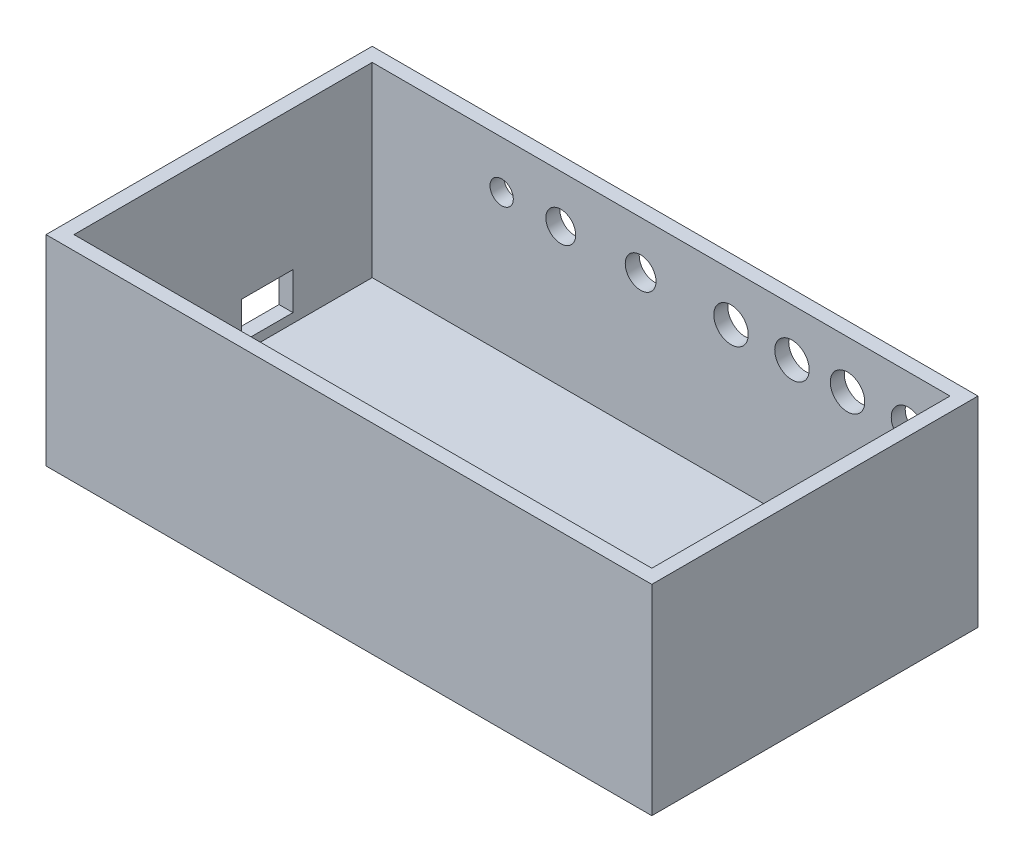
ISO-10303-21;
HEADER;
FILE_DESCRIPTION(('STEP AP214'),'2;1');
FILE_NAME('part.step','',(''),(''),'','','');
FILE_SCHEMA(('AUTOMOTIVE_DESIGN { 1 0 10303 214 1 1 1 1 }'));
ENDSEC;
DATA;
#1=APPLICATION_CONTEXT('core data for automotive mechanical design processes');
#2=APPLICATION_PROTOCOL_DEFINITION('international standard','automotive_design',2000,#1);
#3=PRODUCT_CONTEXT('',#1,'mechanical');
#4=PRODUCT('Part','Part','',(#3));
#5=PRODUCT_RELATED_PRODUCT_CATEGORY('part','',(#4));
#6=PRODUCT_DEFINITION_FORMATION('','',#4);
#7=PRODUCT_DEFINITION_CONTEXT('part definition',#1,'design');
#8=PRODUCT_DEFINITION('design','',#6,#7);
#9=PRODUCT_DEFINITION_SHAPE('','',#8);
#10=(LENGTH_UNIT() NAMED_UNIT(*) SI_UNIT(.MILLI.,.METRE.));
#11=(NAMED_UNIT(*) PLANE_ANGLE_UNIT() SI_UNIT($,.RADIAN.));
#12=(NAMED_UNIT(*) SI_UNIT($,.STERADIAN.) SOLID_ANGLE_UNIT());
#13=UNCERTAINTY_MEASURE_WITH_UNIT(LENGTH_MEASURE(1.E-05),#10,'distance_accuracy_value','');
#14=(GEOMETRIC_REPRESENTATION_CONTEXT(3) GLOBAL_UNCERTAINTY_ASSIGNED_CONTEXT((#13)) GLOBAL_UNIT_ASSIGNED_CONTEXT((#10,
#11,#12)) REPRESENTATION_CONTEXT('',''));
#15=CARTESIAN_POINT('',(0.,0.,0.));
#16=DIRECTION('',(0.,0.,1.));
#17=DIRECTION('',(1.,0.,0.));
#18=AXIS2_PLACEMENT_3D('',#15,#16,#17);
#19=CARTESIAN_POINT('',(0.,43.,70.));
#20=DIRECTION('',(1.,0.,0.));
#21=DIRECTION('',(0.,0.,-1.));
#22=AXIS2_PLACEMENT_3D('',#19,#20,#21);
#23=PLANE('',#22);
#24=DIRECTION('',(0.,0.,1.));
#25=VECTOR('',#24,1.);
#26=CARTESIAN_POINT('',(0.,0.,70.));
#27=LINE('',#26,#25);
#28=CARTESIAN_POINT('',(0.,0.,0.));
#29=VERTEX_POINT('',#28);
#30=CARTESIAN_POINT('',(0.,0.,70.));
#31=VERTEX_POINT('',#30);
#32=EDGE_CURVE('E227',#29,#31,#27,.T.);
#33=ORIENTED_EDGE('',*,*,#32,.T.);
#34=DIRECTION('',(0.,-1.,0.));
#35=VECTOR('',#34,1.);
#36=CARTESIAN_POINT('',(0.,43.,70.));
#37=LINE('',#36,#35);
#38=CARTESIAN_POINT('',(0.,43.,70.));
#39=VERTEX_POINT('',#38);
#40=EDGE_CURVE('E274',#39,#31,#37,.T.);
#41=ORIENTED_EDGE('',*,*,#40,.F.);
#42=DIRECTION('',(0.,0.,1.));
#43=VECTOR('',#42,1.);
#44=CARTESIAN_POINT('',(0.,43.,70.));
#45=LINE('',#44,#43);
#46=CARTESIAN_POINT('',(0.,43.,0.));
#47=VERTEX_POINT('',#46);
#48=EDGE_CURVE('E237',#47,#39,#45,.T.);
#49=ORIENTED_EDGE('',*,*,#48,.F.);
#50=DIRECTION('',(0.,-1.,0.));
#51=VECTOR('',#50,1.);
#52=CARTESIAN_POINT('',(0.,43.,0.));
#53=LINE('',#52,#51);
#54=EDGE_CURVE('E251',#47,#29,#53,.T.);
#55=ORIENTED_EDGE('',*,*,#54,.T.);
#56=EDGE_LOOP('',(#33,#41,#49,#55));
#57=FACE_BOUND('',#56,.T.);
#58=DIRECTION('',(0.,0.,1.));
#59=VECTOR('',#58,1.);
#60=CARTESIAN_POINT('',(0.,13.,20.));
#61=LINE('',#60,#59);
#62=CARTESIAN_POINT('',(0.,13.,20.));
#63=VERTEX_POINT('',#62);
#64=CARTESIAN_POINT('',(0.,13.,31.));
#65=VERTEX_POINT('',#64);
#66=EDGE_CURVE('E53',#63,#65,#61,.T.);
#67=ORIENTED_EDGE('',*,*,#66,.T.);
#68=DIRECTION('',(0.,1.,0.));
#69=VECTOR('',#68,1.);
#70=CARTESIAN_POINT('',(0.,5.,31.));
#71=LINE('',#70,#69);
#72=CARTESIAN_POINT('',(0.,5.,31.));
#73=VERTEX_POINT('',#72);
#74=EDGE_CURVE('E136',#73,#65,#71,.T.);
#75=ORIENTED_EDGE('',*,*,#74,.F.);
#76=DIRECTION('',(0.,0.,1.));
#77=VECTOR('',#76,1.);
#78=CARTESIAN_POINT('',(0.,5.,20.));
#79=LINE('',#78,#77);
#80=CARTESIAN_POINT('',(0.,5.,20.));
#81=VERTEX_POINT('',#80);
#82=EDGE_CURVE('E143',#81,#73,#79,.T.);
#83=ORIENTED_EDGE('',*,*,#82,.F.);
#84=DIRECTION('',(0.,1.,0.));
#85=VECTOR('',#84,1.);
#86=CARTESIAN_POINT('',(0.,5.,20.));
#87=LINE('',#86,#85);
#88=EDGE_CURVE('E146',#81,#63,#87,.T.);
#89=ORIENTED_EDGE('',*,*,#88,.T.);
#90=EDGE_LOOP('',(#67,#75,#83,#89));
#91=FACE_BOUND('',#90,.T.);
#92=ADVANCED_FACE('F38',(#57,#91),#23,.F.);
#93=CARTESIAN_POINT('',(3.,3.,3.));
#94=DIRECTION('',(-1.,0.,0.));
#95=DIRECTION('',(0.,0.,1.));
#96=AXIS2_PLACEMENT_3D('',#93,#94,#95);
#97=PLANE('',#96);
#98=DIRECTION('',(0.,0.,1.));
#99=VECTOR('',#98,1.);
#100=CARTESIAN_POINT('',(3.,43.,3.));
#101=LINE('',#100,#99);
#102=CARTESIAN_POINT('',(3.,43.,3.));
#103=VERTEX_POINT('',#102);
#104=CARTESIAN_POINT('',(3.00000000000001,43.,67.));
#105=VERTEX_POINT('',#104);
#106=EDGE_CURVE('E209',#103,#105,#101,.T.);
#107=ORIENTED_EDGE('',*,*,#106,.T.);
#108=DIRECTION('',(0.,1.,0.));
#109=VECTOR('',#108,1.);
#110=CARTESIAN_POINT('',(3.00000000000001,3.,67.));
#111=LINE('',#110,#109);
#112=CARTESIAN_POINT('',(3.00000000000001,3.,67.));
#113=VERTEX_POINT('',#112);
#114=EDGE_CURVE('E208',#113,#105,#111,.T.);
#115=ORIENTED_EDGE('',*,*,#114,.F.);
#116=DIRECTION('',(0.,0.,1.));
#117=VECTOR('',#116,1.);
#118=CARTESIAN_POINT('',(3.,3.,3.));
#119=LINE('',#118,#117);
#120=CARTESIAN_POINT('',(3.,3.,3.));
#121=VERTEX_POINT('',#120);
#122=EDGE_CURVE('E191',#121,#113,#119,.T.);
#123=ORIENTED_EDGE('',*,*,#122,.F.);
#124=DIRECTION('',(0.,1.,0.));
#125=VECTOR('',#124,1.);
#126=CARTESIAN_POINT('',(3.,3.,3.));
#127=LINE('',#126,#125);
#128=EDGE_CURVE('E224',#121,#103,#127,.T.);
#129=ORIENTED_EDGE('',*,*,#128,.T.);
#130=EDGE_LOOP('',(#107,#115,#123,#129));
#131=FACE_BOUND('',#130,.T.);
#132=DIRECTION('',(0.,0.,1.));
#133=VECTOR('',#132,1.);
#134=CARTESIAN_POINT('',(3.,13.,3.));
#135=LINE('',#134,#133);
#136=CARTESIAN_POINT('',(3.,13.,20.));
#137=VERTEX_POINT('',#136);
#138=CARTESIAN_POINT('',(3.,13.,31.));
#139=VERTEX_POINT('',#138);
#140=EDGE_CURVE('E11',#137,#139,#135,.T.);
#141=ORIENTED_EDGE('',*,*,#140,.F.);
#142=DIRECTION('',(0.,1.,0.));
#143=VECTOR('',#142,1.);
#144=CARTESIAN_POINT('',(3.,3.,20.));
#145=LINE('',#144,#143);
#146=CARTESIAN_POINT('',(3.,5.,20.));
#147=VERTEX_POINT('',#146);
#148=EDGE_CURVE('E278',#147,#137,#145,.T.);
#149=ORIENTED_EDGE('',*,*,#148,.F.);
#150=DIRECTION('',(0.,0.,1.));
#151=VECTOR('',#150,1.);
#152=CARTESIAN_POINT('',(3.,5.,3.));
#153=LINE('',#152,#151);
#154=CARTESIAN_POINT('',(3.,5.,31.));
#155=VERTEX_POINT('',#154);
#156=EDGE_CURVE('E305',#147,#155,#153,.T.);
#157=ORIENTED_EDGE('',*,*,#156,.T.);
#158=DIRECTION('',(0.,1.,0.));
#159=VECTOR('',#158,1.);
#160=CARTESIAN_POINT('',(3.,3.,31.));
#161=LINE('',#160,#159);
#162=EDGE_CURVE('E46',#155,#139,#161,.T.);
#163=ORIENTED_EDGE('',*,*,#162,.T.);
#164=EDGE_LOOP('',(#141,#149,#157,#163));
#165=FACE_BOUND('',#164,.T.);
#166=ADVANCED_FACE('F310',(#131,#165),#97,.F.);
#167=CARTESIAN_POINT('',(0.,43.,70.));
#168=DIRECTION('',(0.,0.,-1.));
#169=DIRECTION('',(-1.,0.,0.));
#170=AXIS2_PLACEMENT_3D('',#167,#168,#169);
#171=PLANE('',#170);
#172=DIRECTION('',(1.,0.,0.));
#173=VECTOR('',#172,1.);
#174=CARTESIAN_POINT('',(0.,0.,70.));
#175=LINE('',#174,#173);
#176=CARTESIAN_POINT('',(130.,0.,70.));
#177=VERTEX_POINT('',#176);
#178=EDGE_CURVE('E255',#31,#177,#175,.T.);
#179=ORIENTED_EDGE('',*,*,#178,.T.);
#180=DIRECTION('',(0.,-1.,0.));
#181=VECTOR('',#180,1.);
#182=CARTESIAN_POINT('',(130.,43.,70.));
#183=LINE('',#182,#181);
#184=CARTESIAN_POINT('',(130.,43.,70.));
#185=VERTEX_POINT('',#184);
#186=EDGE_CURVE('E270',#185,#177,#183,.T.);
#187=ORIENTED_EDGE('',*,*,#186,.F.);
#188=DIRECTION('',(1.,0.,0.));
#189=VECTOR('',#188,1.);
#190=CARTESIAN_POINT('',(0.,43.,70.));
#191=LINE('',#190,#189);
#192=EDGE_CURVE('E241',#39,#185,#191,.T.);
#193=ORIENTED_EDGE('',*,*,#192,.F.);
#194=ORIENTED_EDGE('',*,*,#40,.T.);
#195=EDGE_LOOP('',(#179,#187,#193,#194));
#196=FACE_BOUND('',#195,.T.);
#197=ADVANCED_FACE('F326',(#196),#171,.F.);
#198=CARTESIAN_POINT('',(130.,43.,70.));
#199=DIRECTION('',(-1.,0.,0.));
#200=DIRECTION('',(0.,0.,1.));
#201=AXIS2_PLACEMENT_3D('',#198,#199,#200);
#202=PLANE('',#201);
#203=DIRECTION('',(0.,0.,-1.));
#204=VECTOR('',#203,1.);
#205=CARTESIAN_POINT('',(130.,0.,70.));
#206=LINE('',#205,#204);
#207=CARTESIAN_POINT('',(130.,0.,0.));
#208=VERTEX_POINT('',#207);
#209=EDGE_CURVE('E258',#177,#208,#206,.T.);
#210=ORIENTED_EDGE('',*,*,#209,.T.);
#211=DIRECTION('',(0.,-1.,0.));
#212=VECTOR('',#211,1.);
#213=CARTESIAN_POINT('',(130.,43.,0.));
#214=LINE('',#213,#212);
#215=CARTESIAN_POINT('',(130.,43.,0.));
#216=VERTEX_POINT('',#215);
#217=EDGE_CURVE('E266',#216,#208,#214,.T.);
#218=ORIENTED_EDGE('',*,*,#217,.F.);
#219=DIRECTION('',(0.,0.,-1.));
#220=VECTOR('',#219,1.);
#221=CARTESIAN_POINT('',(130.,43.,70.));
#222=LINE('',#221,#220);
#223=EDGE_CURVE('E245',#185,#216,#222,.T.);
#224=ORIENTED_EDGE('',*,*,#223,.F.);
#225=ORIENTED_EDGE('',*,*,#186,.T.);
#226=EDGE_LOOP('',(#210,#218,#224,#225));
#227=FACE_BOUND('',#226,.T.);
#228=ADVANCED_FACE('F347',(#227),#202,.F.);
#229=CARTESIAN_POINT('',(0.,43.,0.));
#230=DIRECTION('',(0.,0.,1.));
#231=DIRECTION('',(1.,0.,0.));
#232=AXIS2_PLACEMENT_3D('',#229,#230,#231);
#233=PLANE('',#232);
#234=CARTESIAN_POINT('',(60.6000496527819,32.75,0.));
#235=DIRECTION('',(0.,0.,-1.));
#236=DIRECTION('',(-1.,0.,0.));
#237=AXIS2_PLACEMENT_3D('',#234,#235,#236);
#238=CIRCLE('',#237,3.3);
#239=CARTESIAN_POINT('',(57.3000496527819,32.75,0.));
#240=VERTEX_POINT('',#239);
#241=EDGE_CURVE('E161',#240,#240,#238,.T.);
#242=ORIENTED_EDGE('',*,*,#241,.F.);
#243=EDGE_LOOP('',(#242));
#244=FACE_BOUND('',#243,.T.);
#245=CARTESIAN_POINT('',(43.466078799653,32.75,0.));
#246=DIRECTION('',(0.,0.,-1.));
#247=DIRECTION('',(-1.,0.,0.));
#248=AXIS2_PLACEMENT_3D('',#245,#246,#247);
#249=CIRCLE('',#248,3.2);
#250=CARTESIAN_POINT('',(40.266078799653,32.75,0.));
#251=VERTEX_POINT('',#250);
#252=EDGE_CURVE('E166',#251,#251,#249,.T.);
#253=ORIENTED_EDGE('',*,*,#252,.F.);
#254=EDGE_LOOP('',(#253));
#255=FACE_BOUND('',#254,.T.);
#256=CARTESIAN_POINT('',(30.7816650098197,32.75,0.));
#257=DIRECTION('',(0.,0.,-1.));
#258=DIRECTION('',(-1.,0.,0.));
#259=AXIS2_PLACEMENT_3D('',#256,#257,#258);
#260=CIRCLE('',#259,2.5);
#261=CARTESIAN_POINT('',(28.2816650098197,32.75,0.));
#262=VERTEX_POINT('',#261);
#263=EDGE_CURVE('E132',#262,#262,#260,.T.);
#264=ORIENTED_EDGE('',*,*,#263,.F.);
#265=EDGE_LOOP('',(#264));
#266=FACE_BOUND('',#265,.T.);
#267=CARTESIAN_POINT('',(118.081395348837,32.75,0.));
#268=DIRECTION('',(0.,0.,-1.));
#269=DIRECTION('',(-1.,0.,0.));
#270=AXIS2_PLACEMENT_3D('',#267,#268,#269);
#271=CIRCLE('',#270,3.7);
#272=CARTESIAN_POINT('',(114.381395348837,32.75,0.));
#273=VERTEX_POINT('',#272);
#274=EDGE_CURVE('E182',#273,#273,#271,.T.);
#275=ORIENTED_EDGE('',*,*,#274,.F.);
#276=EDGE_LOOP('',(#275));
#277=FACE_BOUND('',#276,.T.);
#278=CARTESIAN_POINT('',(80.,32.75,0.));
#279=DIRECTION('',(0.,0.,-1.));
#280=DIRECTION('',(-1.,0.,0.));
#281=AXIS2_PLACEMENT_3D('',#278,#279,#280);
#282=CIRCLE('',#281,3.7);
#283=CARTESIAN_POINT('',(76.3,32.75,0.));
#284=VERTEX_POINT('',#283);
#285=EDGE_CURVE('E178',#284,#284,#282,.T.);
#286=ORIENTED_EDGE('',*,*,#285,.F.);
#287=EDGE_LOOP('',(#286));
#288=FACE_BOUND('',#287,.T.);
#289=CARTESIAN_POINT('',(93.0813953488372,32.75,0.));
#290=DIRECTION('',(0.,0.,-1.));
#291=DIRECTION('',(-1.,0.,0.));
#292=AXIS2_PLACEMENT_3D('',#289,#290,#291);
#293=CIRCLE('',#292,3.7);
#294=CARTESIAN_POINT('',(89.3813953488372,32.75,0.));
#295=VERTEX_POINT('',#294);
#296=EDGE_CURVE('E173',#295,#295,#293,.T.);
#297=ORIENTED_EDGE('',*,*,#296,.F.);
#298=EDGE_LOOP('',(#297));
#299=FACE_BOUND('',#298,.T.);
#300=CARTESIAN_POINT('',(105.,32.75,0.));
#301=DIRECTION('',(0.,0.,-1.));
#302=DIRECTION('',(-1.,0.,0.));
#303=AXIS2_PLACEMENT_3D('',#300,#301,#302);
#304=CIRCLE('',#303,3.7);
#305=CARTESIAN_POINT('',(101.3,32.75,0.));
#306=VERTEX_POINT('',#305);
#307=EDGE_CURVE('E177',#306,#306,#304,.T.);
#308=ORIENTED_EDGE('',*,*,#307,.F.);
#309=EDGE_LOOP('',(#308));
#310=FACE_BOUND('',#309,.T.);
#311=DIRECTION('',(-1.,0.,0.));
#312=VECTOR('',#311,1.);
#313=CARTESIAN_POINT('',(0.,0.,0.));
#314=LINE('',#313,#312);
#315=EDGE_CURVE('E242',#208,#29,#314,.T.);
#316=ORIENTED_EDGE('',*,*,#315,.T.);
#317=ORIENTED_EDGE('',*,*,#54,.F.);
#318=DIRECTION('',(-1.,0.,0.));
#319=VECTOR('',#318,1.);
#320=CARTESIAN_POINT('',(0.,43.,0.));
#321=LINE('',#320,#319);
#322=EDGE_CURVE('E248',#216,#47,#321,.T.);
#323=ORIENTED_EDGE('',*,*,#322,.F.);
#324=ORIENTED_EDGE('',*,*,#217,.T.);
#325=EDGE_LOOP('',(#316,#317,#323,#324));
#326=FACE_BOUND('',#325,.T.);
#327=ADVANCED_FACE('F345',(#244,#255,#266,#277,#288,#299,#310,#326),#233,.F.);
#328=CARTESIAN_POINT('',(0.,43.,0.));
#329=DIRECTION('',(0.,-1.,0.));
#330=DIRECTION('',(0.,0.,-1.));
#331=AXIS2_PLACEMENT_3D('',#328,#329,#330);
#332=PLANE('',#331);
#333=DIRECTION('',(1.,0.,0.));
#334=VECTOR('',#333,1.);
#335=CARTESIAN_POINT('',(3.00000000000001,43.,67.));
#336=LINE('',#335,#334);
#337=CARTESIAN_POINT('',(127.,43.,67.));
#338=VERTEX_POINT('',#337);
#339=EDGE_CURVE('E212',#105,#338,#336,.T.);
#340=ORIENTED_EDGE('',*,*,#339,.F.);
#341=ORIENTED_EDGE('',*,*,#106,.F.);
#342=DIRECTION('',(-1.,0.,0.));
#343=VECTOR('',#342,1.);
#344=CARTESIAN_POINT('',(3.,43.,3.));
#345=LINE('',#344,#343);
#346=CARTESIAN_POINT('',(127.,43.,3.));
#347=VERTEX_POINT('',#346);
#348=EDGE_CURVE('E196',#347,#103,#345,.T.);
#349=ORIENTED_EDGE('',*,*,#348,.F.);
#350=DIRECTION('',(0.,0.,-1.));
#351=VECTOR('',#350,1.);
#352=CARTESIAN_POINT('',(127.,43.,3.));
#353=LINE('',#352,#351);
#354=EDGE_CURVE('E217',#338,#347,#353,.T.);
#355=ORIENTED_EDGE('',*,*,#354,.F.);
#356=EDGE_LOOP('',(#340,#341,#349,#355));
#357=FACE_BOUND('',#356,.T.);
#358=ORIENTED_EDGE('',*,*,#48,.T.);
#359=ORIENTED_EDGE('',*,*,#192,.T.);
#360=ORIENTED_EDGE('',*,*,#223,.T.);
#361=ORIENTED_EDGE('',*,*,#322,.T.);
#362=EDGE_LOOP('',(#358,#359,#360,#361));
#363=FACE_BOUND('',#362,.T.);
#364=ADVANCED_FACE('F341',(#357,#363),#332,.F.);
#365=CARTESIAN_POINT('',(0.,0.,0.));
#366=DIRECTION('',(0.,-1.,0.));
#367=DIRECTION('',(0.,0.,-1.));
#368=AXIS2_PLACEMENT_3D('',#365,#366,#367);
#369=PLANE('',#368);
#370=ORIENTED_EDGE('',*,*,#32,.F.);
#371=ORIENTED_EDGE('',*,*,#315,.F.);
#372=ORIENTED_EDGE('',*,*,#209,.F.);
#373=ORIENTED_EDGE('',*,*,#178,.F.);
#374=EDGE_LOOP('',(#370,#371,#372,#373));
#375=FACE_BOUND('',#374,.T.);
#376=ADVANCED_FACE('F335',(#375),#369,.T.);
#377=CARTESIAN_POINT('',(3.,3.,3.));
#378=DIRECTION('',(0.,0.,-1.));
#379=DIRECTION('',(-1.,0.,0.));
#380=AXIS2_PLACEMENT_3D('',#377,#378,#379);
#381=PLANE('',#380);
#382=CARTESIAN_POINT('',(60.6000496527819,32.75,3.));
#383=DIRECTION('',(0.,0.,-1.));
#384=DIRECTION('',(-1.,0.,0.));
#385=AXIS2_PLACEMENT_3D('',#382,#383,#384);
#386=CIRCLE('',#385,3.3);
#387=CARTESIAN_POINT('',(57.3000496527819,32.75,3.));
#388=VERTEX_POINT('',#387);
#389=EDGE_CURVE('E186',#388,#388,#386,.T.);
#390=ORIENTED_EDGE('',*,*,#389,.T.);
#391=EDGE_LOOP('',(#390));
#392=FACE_BOUND('',#391,.T.);
#393=CARTESIAN_POINT('',(43.466078799653,32.75,3.));
#394=DIRECTION('',(0.,0.,-1.));
#395=DIRECTION('',(-1.,0.,0.));
#396=AXIS2_PLACEMENT_3D('',#393,#394,#395);
#397=CIRCLE('',#396,3.2);
#398=CARTESIAN_POINT('',(40.266078799653,32.75,3.));
#399=VERTEX_POINT('',#398);
#400=EDGE_CURVE('E296',#399,#399,#397,.T.);
#401=ORIENTED_EDGE('',*,*,#400,.T.);
#402=EDGE_LOOP('',(#401));
#403=FACE_BOUND('',#402,.T.);
#404=CARTESIAN_POINT('',(30.7816650098197,32.75,3.));
#405=DIRECTION('',(0.,0.,-1.));
#406=DIRECTION('',(-1.,0.,0.));
#407=AXIS2_PLACEMENT_3D('',#404,#405,#406);
#408=CIRCLE('',#407,2.5);
#409=CARTESIAN_POINT('',(28.2816650098197,32.75,3.));
#410=VERTEX_POINT('',#409);
#411=EDGE_CURVE('E165',#410,#410,#408,.T.);
#412=ORIENTED_EDGE('',*,*,#411,.T.);
#413=EDGE_LOOP('',(#412));
#414=FACE_BOUND('',#413,.T.);
#415=CARTESIAN_POINT('',(118.081395348837,32.75,3.));
#416=DIRECTION('',(0.,0.,-1.));
#417=DIRECTION('',(-1.,0.,0.));
#418=AXIS2_PLACEMENT_3D('',#415,#416,#417);
#419=CIRCLE('',#418,3.7);
#420=CARTESIAN_POINT('',(114.381395348837,32.75,3.));
#421=VERTEX_POINT('',#420);
#422=EDGE_CURVE('E213',#421,#421,#419,.T.);
#423=ORIENTED_EDGE('',*,*,#422,.T.);
#424=EDGE_LOOP('',(#423));
#425=FACE_BOUND('',#424,.T.);
#426=CARTESIAN_POINT('',(80.,32.75,3.));
#427=DIRECTION('',(0.,0.,-1.));
#428=DIRECTION('',(-1.,0.,0.));
#429=AXIS2_PLACEMENT_3D('',#426,#427,#428);
#430=CIRCLE('',#429,3.7);
#431=CARTESIAN_POINT('',(76.3,32.75,3.));
#432=VERTEX_POINT('',#431);
#433=EDGE_CURVE('E286',#432,#432,#430,.T.);
#434=ORIENTED_EDGE('',*,*,#433,.T.);
#435=EDGE_LOOP('',(#434));
#436=FACE_BOUND('',#435,.T.);
#437=CARTESIAN_POINT('',(93.0813953488372,32.75,3.));
#438=DIRECTION('',(0.,0.,-1.));
#439=DIRECTION('',(-1.,0.,0.));
#440=AXIS2_PLACEMENT_3D('',#437,#438,#439);
#441=CIRCLE('',#440,3.7);
#442=CARTESIAN_POINT('',(89.3813953488372,32.75,3.));
#443=VERTEX_POINT('',#442);
#444=EDGE_CURVE('E282',#443,#443,#441,.T.);
#445=ORIENTED_EDGE('',*,*,#444,.T.);
#446=EDGE_LOOP('',(#445));
#447=FACE_BOUND('',#446,.T.);
#448=CARTESIAN_POINT('',(105.,32.75,3.));
#449=DIRECTION('',(0.,0.,-1.));
#450=DIRECTION('',(-1.,0.,0.));
#451=AXIS2_PLACEMENT_3D('',#448,#449,#450);
#452=CIRCLE('',#451,3.7);
#453=CARTESIAN_POINT('',(101.3,32.75,3.));
#454=VERTEX_POINT('',#453);
#455=EDGE_CURVE('E190',#454,#454,#452,.T.);
#456=ORIENTED_EDGE('',*,*,#455,.T.);
#457=EDGE_LOOP('',(#456));
#458=FACE_BOUND('',#457,.T.);
#459=ORIENTED_EDGE('',*,*,#348,.T.);
#460=ORIENTED_EDGE('',*,*,#128,.F.);
#461=DIRECTION('',(-1.,0.,0.));
#462=VECTOR('',#461,1.);
#463=CARTESIAN_POINT('',(3.,3.,3.));
#464=LINE('',#463,#462);
#465=CARTESIAN_POINT('',(127.,3.,3.));
#466=VERTEX_POINT('',#465);
#467=EDGE_CURVE('E204',#466,#121,#464,.T.);
#468=ORIENTED_EDGE('',*,*,#467,.F.);
#469=DIRECTION('',(0.,1.,0.));
#470=VECTOR('',#469,1.);
#471=CARTESIAN_POINT('',(127.,3.,3.));
#472=LINE('',#471,#470);
#473=EDGE_CURVE('E228',#466,#347,#472,.T.);
#474=ORIENTED_EDGE('',*,*,#473,.T.);
#475=EDGE_LOOP('',(#459,#460,#468,#474));
#476=FACE_BOUND('',#475,.T.);
#477=ADVANCED_FACE('F359',(#392,#403,#414,#425,#436,#447,#458,#476),#381,.F.);
#478=CARTESIAN_POINT('',(127.,3.,3.));
#479=DIRECTION('',(1.,0.,0.));
#480=DIRECTION('',(0.,0.,-1.));
#481=AXIS2_PLACEMENT_3D('',#478,#479,#480);
#482=PLANE('',#481);
#483=ORIENTED_EDGE('',*,*,#354,.T.);
#484=ORIENTED_EDGE('',*,*,#473,.F.);
#485=DIRECTION('',(0.,0.,-1.));
#486=VECTOR('',#485,1.);
#487=CARTESIAN_POINT('',(127.,3.,3.));
#488=LINE('',#487,#486);
#489=CARTESIAN_POINT('',(127.,3.,67.));
#490=VERTEX_POINT('',#489);
#491=EDGE_CURVE('E200',#490,#466,#488,.T.);
#492=ORIENTED_EDGE('',*,*,#491,.F.);
#493=DIRECTION('',(0.,1.,0.));
#494=VECTOR('',#493,1.);
#495=CARTESIAN_POINT('',(127.,3.,67.));
#496=LINE('',#495,#494);
#497=EDGE_CURVE('E231',#490,#338,#496,.T.);
#498=ORIENTED_EDGE('',*,*,#497,.T.);
#499=EDGE_LOOP('',(#483,#484,#492,#498));
#500=FACE_BOUND('',#499,.T.);
#501=ADVANCED_FACE('F367',(#500),#482,.F.);
#502=CARTESIAN_POINT('',(3.00000000000001,3.,67.));
#503=DIRECTION('',(0.,0.,1.));
#504=DIRECTION('',(1.,0.,0.));
#505=AXIS2_PLACEMENT_3D('',#502,#503,#504);
#506=PLANE('',#505);
#507=ORIENTED_EDGE('',*,*,#339,.T.);
#508=ORIENTED_EDGE('',*,*,#497,.F.);
#509=DIRECTION('',(1.,0.,0.));
#510=VECTOR('',#509,1.);
#511=CARTESIAN_POINT('',(3.00000000000001,3.,67.));
#512=LINE('',#511,#510);
#513=EDGE_CURVE('E195',#113,#490,#512,.T.);
#514=ORIENTED_EDGE('',*,*,#513,.F.);
#515=ORIENTED_EDGE('',*,*,#114,.T.);
#516=EDGE_LOOP('',(#507,#508,#514,#515));
#517=FACE_BOUND('',#516,.T.);
#518=ADVANCED_FACE('F363',(#517),#506,.F.);
#519=CARTESIAN_POINT('',(0.,3.,0.));
#520=DIRECTION('',(0.,1.,0.));
#521=DIRECTION('',(0.,0.,1.));
#522=AXIS2_PLACEMENT_3D('',#519,#520,#521);
#523=PLANE('',#522);
#524=ORIENTED_EDGE('',*,*,#122,.T.);
#525=ORIENTED_EDGE('',*,*,#513,.T.);
#526=ORIENTED_EDGE('',*,*,#491,.T.);
#527=ORIENTED_EDGE('',*,*,#467,.T.);
#528=EDGE_LOOP('',(#524,#525,#526,#527));
#529=FACE_BOUND('',#528,.T.);
#530=ADVANCED_FACE('F366',(#529),#523,.T.);
#531=CARTESIAN_POINT('',(105.,32.75,40.));
#532=DIRECTION('',(0.,0.,-1.));
#533=DIRECTION('',(-1.,0.,0.));
#534=AXIS2_PLACEMENT_3D('',#531,#532,#533);
#535=CYLINDRICAL_SURFACE('',#534,3.7);
#536=ORIENTED_EDGE('',*,*,#307,.T.);
#537=EDGE_LOOP('',(#536));
#538=FACE_BOUND('',#537,.T.);
#539=ORIENTED_EDGE('',*,*,#455,.F.);
#540=EDGE_LOOP('',(#539));
#541=FACE_BOUND('',#540,.T.);
#542=ADVANCED_FACE('F377',(#538,#541),#535,.F.);
#543=CARTESIAN_POINT('',(93.0813953488372,32.75,40.));
#544=DIRECTION('',(0.,0.,-1.));
#545=DIRECTION('',(-1.,0.,0.));
#546=AXIS2_PLACEMENT_3D('',#543,#544,#545);
#547=CYLINDRICAL_SURFACE('',#546,3.7);
#548=ORIENTED_EDGE('',*,*,#296,.T.);
#549=EDGE_LOOP('',(#548));
#550=FACE_BOUND('',#549,.T.);
#551=ORIENTED_EDGE('',*,*,#444,.F.);
#552=EDGE_LOOP('',(#551));
#553=FACE_BOUND('',#552,.T.);
#554=ADVANCED_FACE('F381',(#550,#553),#547,.F.);
#555=CARTESIAN_POINT('',(80.,32.75,40.));
#556=DIRECTION('',(0.,0.,-1.));
#557=DIRECTION('',(-1.,0.,0.));
#558=AXIS2_PLACEMENT_3D('',#555,#556,#557);
#559=CYLINDRICAL_SURFACE('',#558,3.7);
#560=ORIENTED_EDGE('',*,*,#285,.T.);
#561=EDGE_LOOP('',(#560));
#562=FACE_BOUND('',#561,.T.);
#563=ORIENTED_EDGE('',*,*,#433,.F.);
#564=EDGE_LOOP('',(#563));
#565=FACE_BOUND('',#564,.T.);
#566=ADVANCED_FACE('F387',(#562,#565),#559,.F.);
#567=CARTESIAN_POINT('',(118.081395348837,32.75,40.));
#568=DIRECTION('',(0.,0.,-1.));
#569=DIRECTION('',(-1.,0.,0.));
#570=AXIS2_PLACEMENT_3D('',#567,#568,#569);
#571=CYLINDRICAL_SURFACE('',#570,3.7);
#572=ORIENTED_EDGE('',*,*,#274,.T.);
#573=EDGE_LOOP('',(#572));
#574=FACE_BOUND('',#573,.T.);
#575=ORIENTED_EDGE('',*,*,#422,.F.);
#576=EDGE_LOOP('',(#575));
#577=FACE_BOUND('',#576,.T.);
#578=ADVANCED_FACE('F383',(#574,#577),#571,.F.);
#579=CARTESIAN_POINT('',(30.7816650098197,32.75,40.));
#580=DIRECTION('',(0.,0.,-1.));
#581=DIRECTION('',(-1.,0.,0.));
#582=AXIS2_PLACEMENT_3D('',#579,#580,#581);
#583=CYLINDRICAL_SURFACE('',#582,2.5);
#584=ORIENTED_EDGE('',*,*,#263,.T.);
#585=EDGE_LOOP('',(#584));
#586=FACE_BOUND('',#585,.T.);
#587=ORIENTED_EDGE('',*,*,#411,.F.);
#588=EDGE_LOOP('',(#587));
#589=FACE_BOUND('',#588,.T.);
#590=ADVANCED_FACE('F386',(#586,#589),#583,.F.);
#591=CARTESIAN_POINT('',(43.466078799653,32.75,40.));
#592=DIRECTION('',(0.,0.,-1.));
#593=DIRECTION('',(-1.,0.,0.));
#594=AXIS2_PLACEMENT_3D('',#591,#592,#593);
#595=CYLINDRICAL_SURFACE('',#594,3.2);
#596=ORIENTED_EDGE('',*,*,#252,.T.);
#597=EDGE_LOOP('',(#596));
#598=FACE_BOUND('',#597,.T.);
#599=ORIENTED_EDGE('',*,*,#400,.F.);
#600=EDGE_LOOP('',(#599));
#601=FACE_BOUND('',#600,.T.);
#602=ADVANCED_FACE('F397',(#598,#601),#595,.F.);
#603=CARTESIAN_POINT('',(60.6000496527819,32.75,40.));
#604=DIRECTION('',(0.,0.,-1.));
#605=DIRECTION('',(-1.,0.,0.));
#606=AXIS2_PLACEMENT_3D('',#603,#604,#605);
#607=CYLINDRICAL_SURFACE('',#606,3.3);
#608=ORIENTED_EDGE('',*,*,#241,.T.);
#609=EDGE_LOOP('',(#608));
#610=FACE_BOUND('',#609,.T.);
#611=ORIENTED_EDGE('',*,*,#389,.F.);
#612=EDGE_LOOP('',(#611));
#613=FACE_BOUND('',#612,.T.);
#614=ADVANCED_FACE('F401',(#610,#613),#607,.F.);
#615=CARTESIAN_POINT('',(40.,13.,20.));
#616=DIRECTION('',(0.,-1.,0.));
#617=DIRECTION('',(0.,0.,-1.));
#618=AXIS2_PLACEMENT_3D('',#615,#616,#617);
#619=PLANE('',#618);
#620=ORIENTED_EDGE('',*,*,#140,.T.);
#621=DIRECTION('',(-1.,0.,0.));
#622=VECTOR('',#621,1.);
#623=CARTESIAN_POINT('',(40.,13.,31.));
#624=LINE('',#623,#622);
#625=EDGE_CURVE('E125',#139,#65,#624,.T.);
#626=ORIENTED_EDGE('',*,*,#625,.T.);
#627=ORIENTED_EDGE('',*,*,#66,.F.);
#628=DIRECTION('',(-1.,0.,0.));
#629=VECTOR('',#628,1.);
#630=CARTESIAN_POINT('',(40.,13.,20.));
#631=LINE('',#630,#629);
#632=EDGE_CURVE('E154',#137,#63,#631,.T.);
#633=ORIENTED_EDGE('',*,*,#632,.F.);
#634=EDGE_LOOP('',(#620,#626,#627,#633));
#635=FACE_BOUND('',#634,.T.);
#636=ADVANCED_FACE('F127',(#635),#619,.T.);
#637=CARTESIAN_POINT('',(40.,5.,31.));
#638=DIRECTION('',(0.,0.,1.));
#639=DIRECTION('',(1.,0.,0.));
#640=AXIS2_PLACEMENT_3D('',#637,#638,#639);
#641=PLANE('',#640);
#642=DIRECTION('',(-1.,0.,0.));
#643=VECTOR('',#642,1.);
#644=CARTESIAN_POINT('',(40.,5.,31.));
#645=LINE('',#644,#643);
#646=EDGE_CURVE('E133',#155,#73,#645,.T.);
#647=ORIENTED_EDGE('',*,*,#646,.T.);
#648=ORIENTED_EDGE('',*,*,#74,.T.);
#649=ORIENTED_EDGE('',*,*,#625,.F.);
#650=ORIENTED_EDGE('',*,*,#162,.F.);
#651=EDGE_LOOP('',(#647,#648,#649,#650));
#652=FACE_BOUND('',#651,.T.);
#653=ADVANCED_FACE('F137',(#652),#641,.F.);
#654=CARTESIAN_POINT('',(40.,5.,20.));
#655=DIRECTION('',(0.,-1.,0.));
#656=DIRECTION('',(0.,0.,-1.));
#657=AXIS2_PLACEMENT_3D('',#654,#655,#656);
#658=PLANE('',#657);
#659=DIRECTION('',(-1.,0.,0.));
#660=VECTOR('',#659,1.);
#661=CARTESIAN_POINT('',(40.,5.,20.));
#662=LINE('',#661,#660);
#663=EDGE_CURVE('E61',#147,#81,#662,.T.);
#664=ORIENTED_EDGE('',*,*,#663,.T.);
#665=ORIENTED_EDGE('',*,*,#82,.T.);
#666=ORIENTED_EDGE('',*,*,#646,.F.);
#667=ORIENTED_EDGE('',*,*,#156,.F.);
#668=EDGE_LOOP('',(#664,#665,#666,#667));
#669=FACE_BOUND('',#668,.T.);
#670=ADVANCED_FACE('F313',(#669),#658,.F.);
#671=CARTESIAN_POINT('',(40.,5.,20.));
#672=DIRECTION('',(0.,0.,1.));
#673=DIRECTION('',(0.,-1.,0.));
#674=AXIS2_PLACEMENT_3D('',#671,#672,#673);
#675=PLANE('',#674);
#676=ORIENTED_EDGE('',*,*,#148,.T.);
#677=ORIENTED_EDGE('',*,*,#632,.T.);
#678=ORIENTED_EDGE('',*,*,#88,.F.);
#679=ORIENTED_EDGE('',*,*,#663,.F.);
#680=EDGE_LOOP('',(#676,#677,#678,#679));
#681=FACE_BOUND('',#680,.T.);
#682=ADVANCED_FACE('F314',(#681),#675,.T.);
#683=CLOSED_SHELL('',(#92,#166,#197,#228,#327,#364,#376,#477,#501,#518,#530,#542,#554,#566,#578,
#590,#602,#614,#636,#653,#670,#682));
#684=MANIFOLD_SOLID_BREP('B2',#683);
#685=ADVANCED_BREP_SHAPE_REPRESENTATION('',(#18,#684),#14);
#686=SHAPE_DEFINITION_REPRESENTATION(#9,#685);
ENDSEC;
END-ISO-10303-21;
